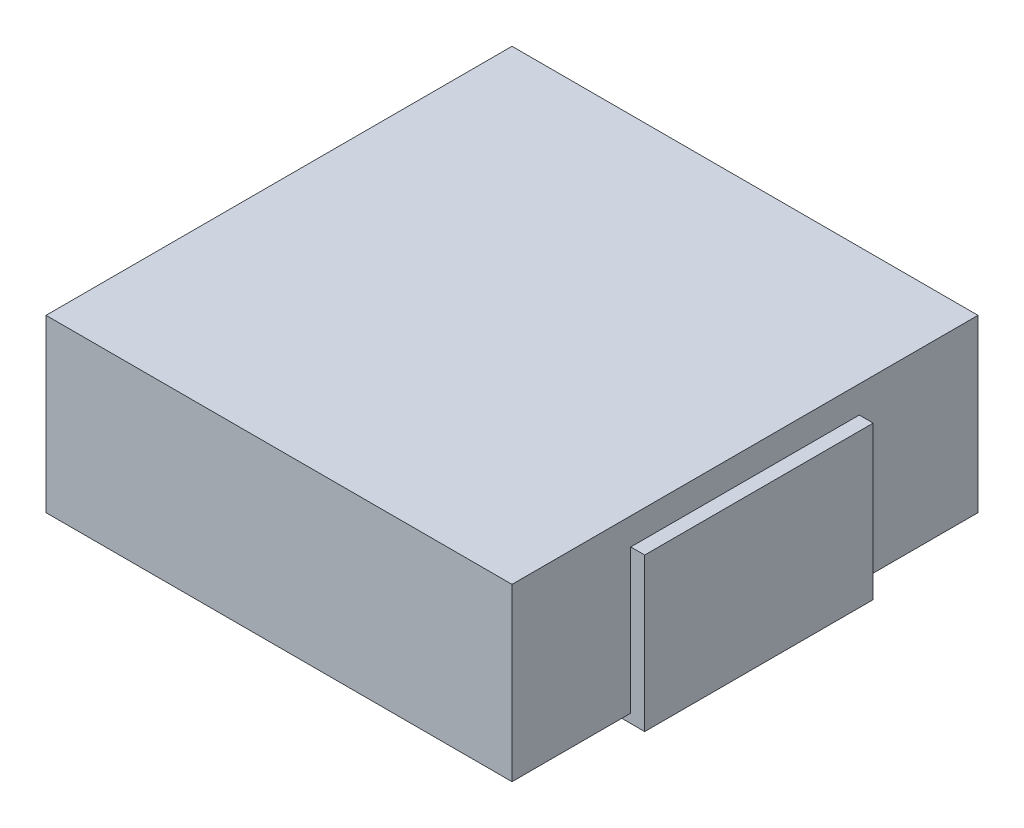
ISO-10303-21;
HEADER;
FILE_DESCRIPTION(('STEP AP214'),'2;1');
FILE_NAME('part.step','',(''),(''),'','','');
FILE_SCHEMA(('AUTOMOTIVE_DESIGN { 1 0 10303 214 1 1 1 1 }'));
ENDSEC;
DATA;
#1=APPLICATION_CONTEXT('core data for automotive mechanical design processes');
#2=APPLICATION_PROTOCOL_DEFINITION('international standard','automotive_design',2000,#1);
#3=PRODUCT_CONTEXT('',#1,'mechanical');
#4=PRODUCT('Part','Part','',(#3));
#5=PRODUCT_RELATED_PRODUCT_CATEGORY('part','',(#4));
#6=PRODUCT_DEFINITION_FORMATION('','',#4);
#7=PRODUCT_DEFINITION_CONTEXT('part definition',#1,'design');
#8=PRODUCT_DEFINITION('design','',#6,#7);
#9=PRODUCT_DEFINITION_SHAPE('','',#8);
#10=(LENGTH_UNIT() NAMED_UNIT(*) SI_UNIT(.MILLI.,.METRE.));
#11=(NAMED_UNIT(*) PLANE_ANGLE_UNIT() SI_UNIT($,.RADIAN.));
#12=(NAMED_UNIT(*) SI_UNIT($,.STERADIAN.) SOLID_ANGLE_UNIT());
#13=UNCERTAINTY_MEASURE_WITH_UNIT(LENGTH_MEASURE(1.E-05),#10,'distance_accuracy_value','');
#14=(GEOMETRIC_REPRESENTATION_CONTEXT(3) GLOBAL_UNCERTAINTY_ASSIGNED_CONTEXT((#13)) GLOBAL_UNIT_ASSIGNED_CONTEXT((#10,
#11,#12)) REPRESENTATION_CONTEXT('',''));
#15=CARTESIAN_POINT('',(0.,0.,0.));
#16=DIRECTION('',(0.,0.,1.));
#17=DIRECTION('',(1.,0.,0.));
#18=AXIS2_PLACEMENT_3D('',#15,#16,#17);
#19=CARTESIAN_POINT('',(2.745,1.7,1.27));
#20=DIRECTION('',(-1.,0.,0.));
#21=DIRECTION('',(0.,0.,1.));
#22=AXIS2_PLACEMENT_3D('',#19,#20,#21);
#23=PLANE('',#22);
#24=DIRECTION('',(0.,0.,-1.));
#25=VECTOR('',#24,1.);
#26=CARTESIAN_POINT('',(2.745,0.,1.27));
#27=LINE('',#26,#25);
#28=CARTESIAN_POINT('',(2.745,0.,1.27));
#29=VERTEX_POINT('',#28);
#30=CARTESIAN_POINT('',(2.745,0.,-1.27));
#31=VERTEX_POINT('',#30);
#32=EDGE_CURVE('E108',#29,#31,#27,.T.);
#33=ORIENTED_EDGE('',*,*,#32,.T.);
#34=DIRECTION('',(0.,-1.,0.));
#35=VECTOR('',#34,1.);
#36=CARTESIAN_POINT('',(2.745,1.7,-1.27));
#37=LINE('',#36,#35);
#38=CARTESIAN_POINT('',(2.745,1.7,-1.27));
#39=VERTEX_POINT('',#38);
#40=EDGE_CURVE('E12',#39,#31,#37,.T.);
#41=ORIENTED_EDGE('',*,*,#40,.F.);
#42=DIRECTION('',(0.,0.,-1.));
#43=VECTOR('',#42,1.);
#44=CARTESIAN_POINT('',(2.745,1.7,1.27));
#45=LINE('',#44,#43);
#46=CARTESIAN_POINT('',(2.745,1.7,1.27));
#47=VERTEX_POINT('',#46);
#48=EDGE_CURVE('E96',#47,#39,#45,.T.);
#49=ORIENTED_EDGE('',*,*,#48,.F.);
#50=DIRECTION('',(0.,-1.,0.));
#51=VECTOR('',#50,1.);
#52=CARTESIAN_POINT('',(2.745,1.7,1.27));
#53=LINE('',#52,#51);
#54=EDGE_CURVE('E104',#47,#29,#53,.T.);
#55=ORIENTED_EDGE('',*,*,#54,.T.);
#56=EDGE_LOOP('',(#33,#41,#49,#55));
#57=FACE_BOUND('',#56,.T.);
#58=ADVANCED_FACE('F45',(#57),#23,.F.);
#59=CARTESIAN_POINT('',(2.745,1.7,-1.27));
#60=DIRECTION('',(0.,0.,1.));
#61=DIRECTION('',(1.,0.,0.));
#62=AXIS2_PLACEMENT_3D('',#59,#60,#61);
#63=PLANE('',#62);
#64=DIRECTION('',(-1.,0.,0.));
#65=VECTOR('',#64,1.);
#66=CARTESIAN_POINT('',(2.745,0.,-1.27));
#67=LINE('',#66,#65);
#68=CARTESIAN_POINT('',(1.725,0.,-1.27));
#69=VERTEX_POINT('',#68);
#70=EDGE_CURVE('E100',#31,#69,#67,.T.);
#71=ORIENTED_EDGE('',*,*,#70,.T.);
#72=DIRECTION('',(0.,-1.,0.));
#73=VECTOR('',#72,1.);
#74=CARTESIAN_POINT('',(1.725,1.7,-1.27));
#75=LINE('',#74,#73);
#76=CARTESIAN_POINT('',(1.725,1.7,-1.27));
#77=VERTEX_POINT('',#76);
#78=EDGE_CURVE('E53',#77,#69,#75,.T.);
#79=ORIENTED_EDGE('',*,*,#78,.F.);
#80=DIRECTION('',(-1.,0.,0.));
#81=VECTOR('',#80,1.);
#82=CARTESIAN_POINT('',(2.745,1.7,-1.27));
#83=LINE('',#82,#81);
#84=EDGE_CURVE('E91',#39,#77,#83,.T.);
#85=ORIENTED_EDGE('',*,*,#84,.F.);
#86=ORIENTED_EDGE('',*,*,#40,.T.);
#87=EDGE_LOOP('',(#71,#79,#85,#86));
#88=FACE_BOUND('',#87,.T.);
#89=ADVANCED_FACE('F99',(#88),#63,.F.);
#90=CARTESIAN_POINT('',(1.725,1.7,1.27));
#91=DIRECTION('',(1.,0.,0.));
#92=DIRECTION('',(0.,0.,-1.));
#93=AXIS2_PLACEMENT_3D('',#90,#91,#92);
#94=PLANE('',#93);
#95=DIRECTION('',(0.,0.,1.));
#96=VECTOR('',#95,1.);
#97=CARTESIAN_POINT('',(1.725,0.,1.27));
#98=LINE('',#97,#96);
#99=CARTESIAN_POINT('',(1.725,0.,1.27));
#100=VERTEX_POINT('',#99);
#101=EDGE_CURVE('E78',#69,#100,#98,.T.);
#102=ORIENTED_EDGE('',*,*,#101,.T.);
#103=DIRECTION('',(0.,-1.,0.));
#104=VECTOR('',#103,1.);
#105=CARTESIAN_POINT('',(1.725,1.7,1.27));
#106=LINE('',#105,#104);
#107=CARTESIAN_POINT('',(1.725,1.7,1.27));
#108=VERTEX_POINT('',#107);
#109=EDGE_CURVE('E101',#108,#100,#106,.T.);
#110=ORIENTED_EDGE('',*,*,#109,.F.);
#111=DIRECTION('',(0.,0.,1.));
#112=VECTOR('',#111,1.);
#113=CARTESIAN_POINT('',(1.725,1.7,1.27));
#114=LINE('',#113,#112);
#115=EDGE_CURVE('E94',#77,#108,#114,.T.);
#116=ORIENTED_EDGE('',*,*,#115,.F.);
#117=ORIENTED_EDGE('',*,*,#78,.T.);
#118=EDGE_LOOP('',(#102,#110,#116,#117));
#119=FACE_BOUND('',#118,.T.);
#120=ADVANCED_FACE('F102',(#119),#94,.F.);
#121=CARTESIAN_POINT('',(2.745,1.7,1.27));
#122=DIRECTION('',(0.,0.,-1.));
#123=DIRECTION('',(-1.,0.,0.));
#124=AXIS2_PLACEMENT_3D('',#121,#122,#123);
#125=PLANE('',#124);
#126=DIRECTION('',(1.,0.,0.));
#127=VECTOR('',#126,1.);
#128=CARTESIAN_POINT('',(2.745,0.,1.27));
#129=LINE('',#128,#127);
#130=EDGE_CURVE('E84',#100,#29,#129,.T.);
#131=ORIENTED_EDGE('',*,*,#130,.T.);
#132=ORIENTED_EDGE('',*,*,#54,.F.);
#133=DIRECTION('',(1.,0.,0.));
#134=VECTOR('',#133,1.);
#135=CARTESIAN_POINT('',(2.745,1.7,1.27));
#136=LINE('',#135,#134);
#137=EDGE_CURVE('E61',#108,#47,#136,.T.);
#138=ORIENTED_EDGE('',*,*,#137,.F.);
#139=ORIENTED_EDGE('',*,*,#109,.T.);
#140=EDGE_LOOP('',(#131,#132,#138,#139));
#141=FACE_BOUND('',#140,.T.);
#142=ADVANCED_FACE('F115',(#141),#125,.F.);
#143=CARTESIAN_POINT('',(2.745,1.7,-1.27));
#144=DIRECTION('',(0.,1.,0.));
#145=DIRECTION('',(0.,0.,1.));
#146=AXIS2_PLACEMENT_3D('',#143,#144,#145);
#147=PLANE('',#146);
#148=ORIENTED_EDGE('',*,*,#48,.T.);
#149=ORIENTED_EDGE('',*,*,#84,.T.);
#150=ORIENTED_EDGE('',*,*,#115,.T.);
#151=ORIENTED_EDGE('',*,*,#137,.T.);
#152=EDGE_LOOP('',(#148,#149,#150,#151));
#153=FACE_BOUND('',#152,.T.);
#154=ADVANCED_FACE('F92',(#153),#147,.T.);
#155=CARTESIAN_POINT('',(2.745,0.,-1.27));
#156=DIRECTION('',(0.,1.,0.));
#157=DIRECTION('',(0.,0.,1.));
#158=AXIS2_PLACEMENT_3D('',#155,#156,#157);
#159=PLANE('',#158);
#160=ORIENTED_EDGE('',*,*,#32,.F.);
#161=ORIENTED_EDGE('',*,*,#130,.F.);
#162=ORIENTED_EDGE('',*,*,#101,.F.);
#163=ORIENTED_EDGE('',*,*,#70,.F.);
#164=EDGE_LOOP('',(#160,#161,#162,#163));
#165=FACE_BOUND('',#164,.T.);
#166=ADVANCED_FACE('F118',(#165),#159,.F.);
#167=CLOSED_SHELL('',(#58,#89,#120,#142,#154,#166));
#168=MANIFOLD_SOLID_BREP('B2',#167);
#169=CARTESIAN_POINT('',(-1.725,1.7,1.27));
#170=DIRECTION('',(-1.,0.,0.));
#171=DIRECTION('',(0.,0.,1.));
#172=AXIS2_PLACEMENT_3D('',#169,#170,#171);
#173=PLANE('',#172);
#174=DIRECTION('',(0.,0.,-1.));
#175=VECTOR('',#174,1.);
#176=CARTESIAN_POINT('',(-1.725,0.,1.27));
#177=LINE('',#176,#175);
#178=CARTESIAN_POINT('',(-1.725,0.,1.27));
#179=VERTEX_POINT('',#178);
#180=CARTESIAN_POINT('',(-1.725,0.,-1.27));
#181=VERTEX_POINT('',#180);
#182=EDGE_CURVE('E240',#179,#181,#177,.T.);
#183=ORIENTED_EDGE('',*,*,#182,.T.);
#184=DIRECTION('',(0.,-1.,0.));
#185=VECTOR('',#184,1.);
#186=CARTESIAN_POINT('',(-1.725,1.7,-1.27));
#187=LINE('',#186,#185);
#188=CARTESIAN_POINT('',(-1.725,1.7,-1.27));
#189=VERTEX_POINT('',#188);
#190=EDGE_CURVE('E43',#189,#181,#187,.T.);
#191=ORIENTED_EDGE('',*,*,#190,.F.);
#192=DIRECTION('',(0.,0.,-1.));
#193=VECTOR('',#192,1.);
#194=CARTESIAN_POINT('',(-1.725,1.7,1.27));
#195=LINE('',#194,#193);
#196=CARTESIAN_POINT('',(-1.725,1.7,1.27));
#197=VERTEX_POINT('',#196);
#198=EDGE_CURVE('E228',#197,#189,#195,.T.);
#199=ORIENTED_EDGE('',*,*,#198,.F.);
#200=DIRECTION('',(0.,-1.,0.));
#201=VECTOR('',#200,1.);
#202=CARTESIAN_POINT('',(-1.725,1.7,1.27));
#203=LINE('',#202,#201);
#204=EDGE_CURVE('E236',#197,#179,#203,.T.);
#205=ORIENTED_EDGE('',*,*,#204,.T.);
#206=EDGE_LOOP('',(#183,#191,#199,#205));
#207=FACE_BOUND('',#206,.T.);
#208=ADVANCED_FACE('F177',(#207),#173,.F.);
#209=CARTESIAN_POINT('',(-2.745,1.7,-1.27));
#210=DIRECTION('',(0.,0.,1.));
#211=DIRECTION('',(1.,0.,0.));
#212=AXIS2_PLACEMENT_3D('',#209,#210,#211);
#213=PLANE('',#212);
#214=DIRECTION('',(-1.,0.,0.));
#215=VECTOR('',#214,1.);
#216=CARTESIAN_POINT('',(-2.745,0.,-1.27));
#217=LINE('',#216,#215);
#218=CARTESIAN_POINT('',(-2.745,0.,-1.27));
#219=VERTEX_POINT('',#218);
#220=EDGE_CURVE('E232',#181,#219,#217,.T.);
#221=ORIENTED_EDGE('',*,*,#220,.T.);
#222=DIRECTION('',(0.,-1.,0.));
#223=VECTOR('',#222,1.);
#224=CARTESIAN_POINT('',(-2.745,1.7,-1.27));
#225=LINE('',#224,#223);
#226=CARTESIAN_POINT('',(-2.745,1.7,-1.27));
#227=VERTEX_POINT('',#226);
#228=EDGE_CURVE('E185',#227,#219,#225,.T.);
#229=ORIENTED_EDGE('',*,*,#228,.F.);
#230=DIRECTION('',(-1.,0.,0.));
#231=VECTOR('',#230,1.);
#232=CARTESIAN_POINT('',(-2.745,1.7,-1.27));
#233=LINE('',#232,#231);
#234=EDGE_CURVE('E223',#189,#227,#233,.T.);
#235=ORIENTED_EDGE('',*,*,#234,.F.);
#236=ORIENTED_EDGE('',*,*,#190,.T.);
#237=EDGE_LOOP('',(#221,#229,#235,#236));
#238=FACE_BOUND('',#237,.T.);
#239=ADVANCED_FACE('F231',(#238),#213,.F.);
#240=CARTESIAN_POINT('',(-2.745,1.7,1.27));
#241=DIRECTION('',(1.,0.,0.));
#242=DIRECTION('',(0.,0.,-1.));
#243=AXIS2_PLACEMENT_3D('',#240,#241,#242);
#244=PLANE('',#243);
#245=DIRECTION('',(0.,0.,1.));
#246=VECTOR('',#245,1.);
#247=CARTESIAN_POINT('',(-2.745,0.,1.27));
#248=LINE('',#247,#246);
#249=CARTESIAN_POINT('',(-2.745,0.,1.27));
#250=VERTEX_POINT('',#249);
#251=EDGE_CURVE('E210',#219,#250,#248,.T.);
#252=ORIENTED_EDGE('',*,*,#251,.T.);
#253=DIRECTION('',(0.,-1.,0.));
#254=VECTOR('',#253,1.);
#255=CARTESIAN_POINT('',(-2.745,1.7,1.27));
#256=LINE('',#255,#254);
#257=CARTESIAN_POINT('',(-2.745,1.7,1.27));
#258=VERTEX_POINT('',#257);
#259=EDGE_CURVE('E233',#258,#250,#256,.T.);
#260=ORIENTED_EDGE('',*,*,#259,.F.);
#261=DIRECTION('',(0.,0.,1.));
#262=VECTOR('',#261,1.);
#263=CARTESIAN_POINT('',(-2.745,1.7,1.27));
#264=LINE('',#263,#262);
#265=EDGE_CURVE('E226',#227,#258,#264,.T.);
#266=ORIENTED_EDGE('',*,*,#265,.F.);
#267=ORIENTED_EDGE('',*,*,#228,.T.);
#268=EDGE_LOOP('',(#252,#260,#266,#267));
#269=FACE_BOUND('',#268,.T.);
#270=ADVANCED_FACE('F234',(#269),#244,.F.);
#271=CARTESIAN_POINT('',(-2.745,1.7,1.27));
#272=DIRECTION('',(0.,0.,-1.));
#273=DIRECTION('',(-1.,0.,0.));
#274=AXIS2_PLACEMENT_3D('',#271,#272,#273);
#275=PLANE('',#274);
#276=DIRECTION('',(1.,0.,0.));
#277=VECTOR('',#276,1.);
#278=CARTESIAN_POINT('',(-2.745,0.,1.27));
#279=LINE('',#278,#277);
#280=EDGE_CURVE('E216',#250,#179,#279,.T.);
#281=ORIENTED_EDGE('',*,*,#280,.T.);
#282=ORIENTED_EDGE('',*,*,#204,.F.);
#283=DIRECTION('',(1.,0.,0.));
#284=VECTOR('',#283,1.);
#285=CARTESIAN_POINT('',(-2.745,1.7,1.27));
#286=LINE('',#285,#284);
#287=EDGE_CURVE('E193',#258,#197,#286,.T.);
#288=ORIENTED_EDGE('',*,*,#287,.F.);
#289=ORIENTED_EDGE('',*,*,#259,.T.);
#290=EDGE_LOOP('',(#281,#282,#288,#289));
#291=FACE_BOUND('',#290,.T.);
#292=ADVANCED_FACE('F247',(#291),#275,.F.);
#293=CARTESIAN_POINT('',(-1.725,1.7,-1.27));
#294=DIRECTION('',(0.,-1.,0.));
#295=DIRECTION('',(0.,0.,-1.));
#296=AXIS2_PLACEMENT_3D('',#293,#294,#295);
#297=PLANE('',#296);
#298=ORIENTED_EDGE('',*,*,#198,.T.);
#299=ORIENTED_EDGE('',*,*,#234,.T.);
#300=ORIENTED_EDGE('',*,*,#265,.T.);
#301=ORIENTED_EDGE('',*,*,#287,.T.);
#302=EDGE_LOOP('',(#298,#299,#300,#301));
#303=FACE_BOUND('',#302,.T.);
#304=ADVANCED_FACE('F224',(#303),#297,.F.);
#305=CARTESIAN_POINT('',(-1.725,0.,-1.27));
#306=DIRECTION('',(0.,-1.,0.));
#307=DIRECTION('',(0.,0.,-1.));
#308=AXIS2_PLACEMENT_3D('',#305,#306,#307);
#309=PLANE('',#308);
#310=ORIENTED_EDGE('',*,*,#182,.F.);
#311=ORIENTED_EDGE('',*,*,#280,.F.);
#312=ORIENTED_EDGE('',*,*,#251,.F.);
#313=ORIENTED_EDGE('',*,*,#220,.F.);
#314=EDGE_LOOP('',(#310,#311,#312,#313));
#315=FACE_BOUND('',#314,.T.);
#316=ADVANCED_FACE('F250',(#315),#309,.T.);
#317=CLOSED_SHELL('',(#208,#239,#270,#292,#304,#316));
#318=MANIFOLD_SOLID_BREP('B6',#317);
#319=CARTESIAN_POINT('',(2.59,2.,2.59));
#320=DIRECTION('',(-1.,0.,0.));
#321=DIRECTION('',(0.,0.,1.));
#322=AXIS2_PLACEMENT_3D('',#319,#320,#321);
#323=PLANE('',#322);
#324=DIRECTION('',(0.,0.,-1.));
#325=VECTOR('',#324,1.);
#326=CARTESIAN_POINT('',(2.59,0.1,2.59));
#327=LINE('',#326,#325);
#328=CARTESIAN_POINT('',(2.59,0.1,2.59));
#329=VERTEX_POINT('',#328);
#330=CARTESIAN_POINT('',(2.59,0.1,-2.59));
#331=VERTEX_POINT('',#330);
#332=EDGE_CURVE('E363',#329,#331,#327,.T.);
#333=ORIENTED_EDGE('',*,*,#332,.T.);
#334=DIRECTION('',(0.,-1.,0.));
#335=VECTOR('',#334,1.);
#336=CARTESIAN_POINT('',(2.59,2.,-2.59));
#337=LINE('',#336,#335);
#338=CARTESIAN_POINT('',(2.59,2.,-2.59));
#339=VERTEX_POINT('',#338);
#340=EDGE_CURVE('E175',#339,#331,#337,.T.);
#341=ORIENTED_EDGE('',*,*,#340,.F.);
#342=DIRECTION('',(0.,0.,-1.));
#343=VECTOR('',#342,1.);
#344=CARTESIAN_POINT('',(2.59,2.,2.59));
#345=LINE('',#344,#343);
#346=CARTESIAN_POINT('',(2.59,2.,2.59));
#347=VERTEX_POINT('',#346);
#348=EDGE_CURVE('E351',#347,#339,#345,.T.);
#349=ORIENTED_EDGE('',*,*,#348,.F.);
#350=DIRECTION('',(0.,-1.,0.));
#351=VECTOR('',#350,1.);
#352=CARTESIAN_POINT('',(2.59,2.,2.59));
#353=LINE('',#352,#351);
#354=EDGE_CURVE('E359',#347,#329,#353,.T.);
#355=ORIENTED_EDGE('',*,*,#354,.T.);
#356=EDGE_LOOP('',(#333,#341,#349,#355));
#357=FACE_BOUND('',#356,.T.);
#358=ADVANCED_FACE('F300',(#357),#323,.F.);
#359=CARTESIAN_POINT('',(-2.59,2.,-2.59));
#360=DIRECTION('',(0.,0.,1.));
#361=DIRECTION('',(1.,0.,0.));
#362=AXIS2_PLACEMENT_3D('',#359,#360,#361);
#363=PLANE('',#362);
#364=DIRECTION('',(-1.,0.,0.));
#365=VECTOR('',#364,1.);
#366=CARTESIAN_POINT('',(-2.59,0.1,-2.59));
#367=LINE('',#366,#365);
#368=CARTESIAN_POINT('',(-2.59,0.1,-2.59));
#369=VERTEX_POINT('',#368);
#370=EDGE_CURVE('E355',#331,#369,#367,.T.);
#371=ORIENTED_EDGE('',*,*,#370,.T.);
#372=DIRECTION('',(0.,-1.,0.));
#373=VECTOR('',#372,1.);
#374=CARTESIAN_POINT('',(-2.59,2.,-2.59));
#375=LINE('',#374,#373);
#376=CARTESIAN_POINT('',(-2.59,2.,-2.59));
#377=VERTEX_POINT('',#376);
#378=EDGE_CURVE('E308',#377,#369,#375,.T.);
#379=ORIENTED_EDGE('',*,*,#378,.F.);
#380=DIRECTION('',(-1.,0.,0.));
#381=VECTOR('',#380,1.);
#382=CARTESIAN_POINT('',(-2.59,2.,-2.59));
#383=LINE('',#382,#381);
#384=EDGE_CURVE('E346',#339,#377,#383,.T.);
#385=ORIENTED_EDGE('',*,*,#384,.F.);
#386=ORIENTED_EDGE('',*,*,#340,.T.);
#387=EDGE_LOOP('',(#371,#379,#385,#386));
#388=FACE_BOUND('',#387,.T.);
#389=ADVANCED_FACE('F354',(#388),#363,.F.);
#390=CARTESIAN_POINT('',(-2.59,2.,2.59));
#391=DIRECTION('',(1.,0.,0.));
#392=DIRECTION('',(0.,0.,-1.));
#393=AXIS2_PLACEMENT_3D('',#390,#391,#392);
#394=PLANE('',#393);
#395=DIRECTION('',(0.,0.,1.));
#396=VECTOR('',#395,1.);
#397=CARTESIAN_POINT('',(-2.59,0.1,2.59));
#398=LINE('',#397,#396);
#399=CARTESIAN_POINT('',(-2.59,0.1,2.59));
#400=VERTEX_POINT('',#399);
#401=EDGE_CURVE('E333',#369,#400,#398,.T.);
#402=ORIENTED_EDGE('',*,*,#401,.T.);
#403=DIRECTION('',(0.,-1.,0.));
#404=VECTOR('',#403,1.);
#405=CARTESIAN_POINT('',(-2.59,2.,2.59));
#406=LINE('',#405,#404);
#407=CARTESIAN_POINT('',(-2.59,2.,2.59));
#408=VERTEX_POINT('',#407);
#409=EDGE_CURVE('E356',#408,#400,#406,.T.);
#410=ORIENTED_EDGE('',*,*,#409,.F.);
#411=DIRECTION('',(0.,0.,1.));
#412=VECTOR('',#411,1.);
#413=CARTESIAN_POINT('',(-2.59,2.,2.59));
#414=LINE('',#413,#412);
#415=EDGE_CURVE('E349',#377,#408,#414,.T.);
#416=ORIENTED_EDGE('',*,*,#415,.F.);
#417=ORIENTED_EDGE('',*,*,#378,.T.);
#418=EDGE_LOOP('',(#402,#410,#416,#417));
#419=FACE_BOUND('',#418,.T.);
#420=ADVANCED_FACE('F357',(#419),#394,.F.);
#421=CARTESIAN_POINT('',(-2.59,2.,2.59));
#422=DIRECTION('',(0.,0.,-1.));
#423=DIRECTION('',(-1.,0.,0.));
#424=AXIS2_PLACEMENT_3D('',#421,#422,#423);
#425=PLANE('',#424);
#426=DIRECTION('',(1.,0.,0.));
#427=VECTOR('',#426,1.);
#428=CARTESIAN_POINT('',(-2.59,0.1,2.59));
#429=LINE('',#428,#427);
#430=EDGE_CURVE('E339',#400,#329,#429,.T.);
#431=ORIENTED_EDGE('',*,*,#430,.T.);
#432=ORIENTED_EDGE('',*,*,#354,.F.);
#433=DIRECTION('',(1.,0.,0.));
#434=VECTOR('',#433,1.);
#435=CARTESIAN_POINT('',(-2.59,2.,2.59));
#436=LINE('',#435,#434);
#437=EDGE_CURVE('E316',#408,#347,#436,.T.);
#438=ORIENTED_EDGE('',*,*,#437,.F.);
#439=ORIENTED_EDGE('',*,*,#409,.T.);
#440=EDGE_LOOP('',(#431,#432,#438,#439));
#441=FACE_BOUND('',#440,.T.);
#442=ADVANCED_FACE('F370',(#441),#425,.F.);
#443=CARTESIAN_POINT('',(2.59,2.,-2.59));
#444=DIRECTION('',(0.,-1.,0.));
#445=DIRECTION('',(0.,0.,-1.));
#446=AXIS2_PLACEMENT_3D('',#443,#444,#445);
#447=PLANE('',#446);
#448=ORIENTED_EDGE('',*,*,#348,.T.);
#449=ORIENTED_EDGE('',*,*,#384,.T.);
#450=ORIENTED_EDGE('',*,*,#415,.T.);
#451=ORIENTED_EDGE('',*,*,#437,.T.);
#452=EDGE_LOOP('',(#448,#449,#450,#451));
#453=FACE_BOUND('',#452,.T.);
#454=ADVANCED_FACE('F347',(#453),#447,.F.);
#455=CARTESIAN_POINT('',(2.59,0.1,-2.59));
#456=DIRECTION('',(0.,-1.,0.));
#457=DIRECTION('',(0.,0.,-1.));
#458=AXIS2_PLACEMENT_3D('',#455,#456,#457);
#459=PLANE('',#458);
#460=ORIENTED_EDGE('',*,*,#332,.F.);
#461=ORIENTED_EDGE('',*,*,#430,.F.);
#462=ORIENTED_EDGE('',*,*,#401,.F.);
#463=ORIENTED_EDGE('',*,*,#370,.F.);
#464=EDGE_LOOP('',(#460,#461,#462,#463));
#465=FACE_BOUND('',#464,.T.);
#466=ADVANCED_FACE('F373',(#465),#459,.T.);
#467=CLOSED_SHELL('',(#358,#389,#420,#442,#454,#466));
#468=MANIFOLD_SOLID_BREP('B37',#467);
#469=ADVANCED_BREP_SHAPE_REPRESENTATION('',(#18,#168,#318,#468),#14);
#470=SHAPE_DEFINITION_REPRESENTATION(#9,#469);
ENDSEC;
END-ISO-10303-21;
